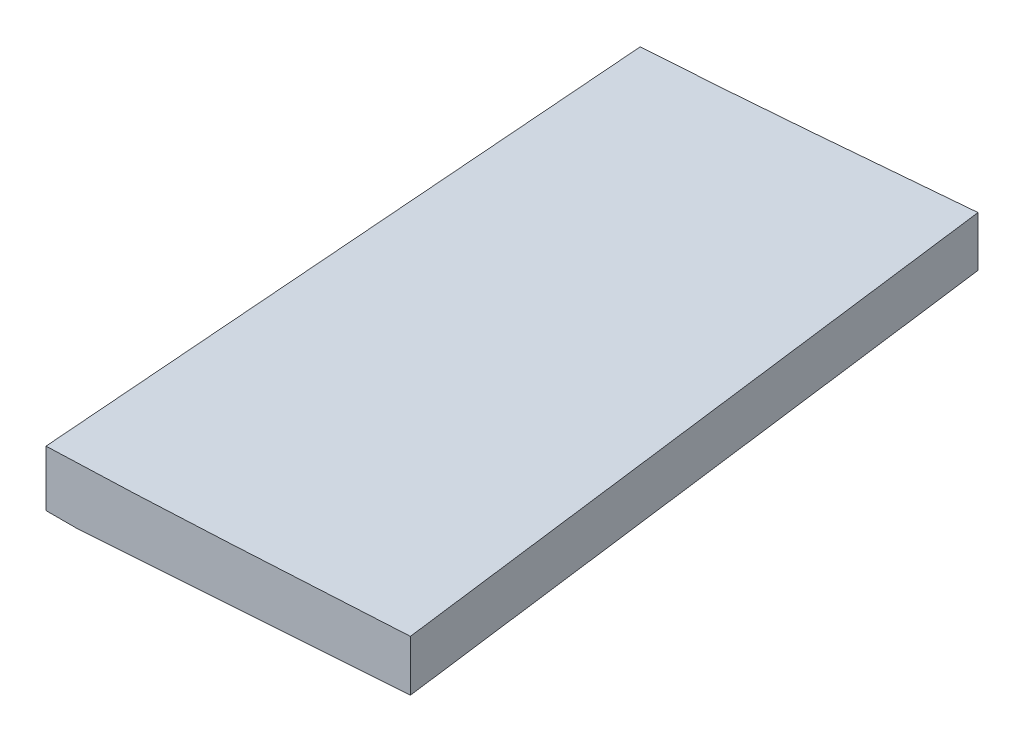
ISO-10303-21;
HEADER;
FILE_DESCRIPTION(('STEP AP214'),'2;1');
FILE_NAME('part.step','',(''),(''),'','','');
FILE_SCHEMA(('AUTOMOTIVE_DESIGN { 1 0 10303 214 1 1 1 1 }'));
ENDSEC;
DATA;
#1=APPLICATION_CONTEXT('core data for automotive mechanical design processes');
#2=APPLICATION_PROTOCOL_DEFINITION('international standard','automotive_design',2000,#1);
#3=PRODUCT_CONTEXT('',#1,'mechanical');
#4=PRODUCT('Part','Part','',(#3));
#5=PRODUCT_RELATED_PRODUCT_CATEGORY('part','',(#4));
#6=PRODUCT_DEFINITION_FORMATION('','',#4);
#7=PRODUCT_DEFINITION_CONTEXT('part definition',#1,'design');
#8=PRODUCT_DEFINITION('design','',#6,#7);
#9=PRODUCT_DEFINITION_SHAPE('','',#8);
#10=(LENGTH_UNIT() NAMED_UNIT(*) SI_UNIT(.MILLI.,.METRE.));
#11=(NAMED_UNIT(*) PLANE_ANGLE_UNIT() SI_UNIT($,.RADIAN.));
#12=(NAMED_UNIT(*) SI_UNIT($,.STERADIAN.) SOLID_ANGLE_UNIT());
#13=UNCERTAINTY_MEASURE_WITH_UNIT(LENGTH_MEASURE(1.E-05),#10,'distance_accuracy_value','');
#14=(GEOMETRIC_REPRESENTATION_CONTEXT(3) GLOBAL_UNCERTAINTY_ASSIGNED_CONTEXT((#13)) GLOBAL_UNIT_ASSIGNED_CONTEXT((#10,
#11,#12)) REPRESENTATION_CONTEXT('',''));
#15=CARTESIAN_POINT('',(0.,0.,0.));
#16=DIRECTION('',(0.,0.,1.));
#17=DIRECTION('',(1.,0.,0.));
#18=AXIS2_PLACEMENT_3D('',#15,#16,#17);
#19=CARTESIAN_POINT('',(0.,0.,50.8));
#20=DIRECTION('',(0.,0.,1.));
#21=DIRECTION('',(1.,0.,0.));
#22=AXIS2_PLACEMENT_3D('',#19,#20,#21);
#23=PLANE('',#22);
#24=DIRECTION('',(1.,0.,0.));
#25=VECTOR('',#24,1.);
#26=CARTESIAN_POINT('',(104.715608500928,-1.74770003692308,50.8));
#27=LINE('',#26,#25);
#28=CARTESIAN_POINT('',(129.715608500912,-1.74770003690514,50.7999999997698));
#29=VERTEX_POINT('',#28);
#30=CARTESIAN_POINT('',(122.012987748225,-1.74770003692157,50.7999999999811));
#31=VERTEX_POINT('',#30);
#32=EDGE_CURVE('E112',#29,#31,#27,.F.);
#33=ORIENTED_EDGE('',*,*,#32,.F.);
#34=CARTESIAN_POINT('',(209.230847335754,3.59145350647107,50.8));
#35=CARTESIAN_POINT('',(202.319868733382,3.12740691070065,50.8));
#36=CARTESIAN_POINT('',(195.408890131011,2.66336031493021,50.8));
#37=CARTESIAN_POINT('',(181.586932926267,1.73526712338933,50.8));
#38=CARTESIAN_POINT('',(174.675954323895,1.27122052761888,50.8));
#39=CARTESIAN_POINT('',(155.081853314658,-0.044450724408742,50.8));
#40=CARTESIAN_POINT('',(142.398730907793,-0.896075380665919,50.8));
#41=CARTESIAN_POINT('',(129.715608500928,-1.74770003692305,50.8));
#42=B_SPLINE_CURVE_WITH_KNOTS('',3,(#34,#35,#36,#37,#38,#39,#40,#41),.UNSPECIFIED.,.F.,.F.,(4,2,
2,4),(0.,20.7796217571299,41.5592435142597,79.694289428537),.UNSPECIFIED.);
#43=CARTESIAN_POINT('',(209.230847335754,3.59145350647107,50.8));
#44=VERTEX_POINT('',#43);
#45=EDGE_CURVE('E177',#44,#29,#42,.T.);
#46=ORIENTED_EDGE('',*,*,#45,.F.);
#47=DIRECTION('',(0.,-1.,0.));
#48=VECTOR('',#47,1.);
#49=CARTESIAN_POINT('',(209.230847335755,-23.8937090007613,50.8));
#50=LINE('',#49,#48);
#51=CARTESIAN_POINT('',(209.230847335754,15.7935965768528,50.8));
#52=VERTEX_POINT('',#51);
#53=EDGE_CURVE('E117',#52,#44,#50,.T.);
#54=ORIENTED_EDGE('',*,*,#53,.F.);
#55=CARTESIAN_POINT('',(122.012987748225,11.6136738216543,50.8));
#56=CARTESIAN_POINT('',(123.831202305895,11.6697555950184,50.8));
#57=CARTESIAN_POINT('',(125.649334594828,11.7285001151568,50.8));
#58=CARTESIAN_POINT('',(129.285388028684,11.8512745189948,50.8));
#59=CARTESIAN_POINT('',(131.103309176813,11.9153043077251,50.8));
#60=CARTESIAN_POINT('',(134.738938573084,12.0486103856979,50.8));
#61=CARTESIAN_POINT('',(136.556646823394,12.1178866158299,50.8));
#62=CARTESIAN_POINT('',(140.191844699359,12.2617617648499,50.8));
#63=CARTESIAN_POINT('',(142.009334325955,12.3363606599174,50.8));
#64=CARTESIAN_POINT('',(145.644035146053,12.4909545186657,50.8));
#65=CARTESIAN_POINT('',(147.461246345696,12.5709493380962,50.8));
#66=CARTESIAN_POINT('',(151.095456853728,12.7357190031892,50.8));
#67=CARTESIAN_POINT('',(152.912456161464,12.8204938631751,50.8));
#68=CARTESIAN_POINT('',(156.546261870725,12.9942063275107,50.8));
#69=CARTESIAN_POINT('',(158.363068271531,13.0831439468572,50.8));
#70=CARTESIAN_POINT('',(161.996512725705,13.2644390995254,50.8));
#71=CARTESIAN_POINT('',(163.813150778803,13.356796638236,50.8));
#72=CARTESIAN_POINT('',(167.446628356927,13.5439205111833,50.8));
#73=CARTESIAN_POINT('',(169.263467859824,13.6386872735613,50.8));
#74=CARTESIAN_POINT('',(171.988668912855,13.7819091882723,50.8));
#75=CARTESIAN_POINT('',(172.897058736758,13.8298284109242,50.8));
#76=CARTESIAN_POINT('',(174.713829807656,13.9258292212547,50.8));
#77=CARTESIAN_POINT('',(175.622211054652,13.9739108089329,50.8));
#78=CARTESIAN_POINT('',(178.347339366335,14.1184098901947,50.8));
#79=CARTESIAN_POINT('',(180.164072942083,14.2150818041659,50.8));
#80=CARTESIAN_POINT('',(183.797507896264,14.4090094308073,50.8));
#81=CARTESIAN_POINT('',(185.614209274715,14.5062651431468,50.8));
#82=CARTESIAN_POINT('',(189.247637835783,14.7014678488801,50.8));
#83=CARTESIAN_POINT('',(191.064365017125,14.799414866031,50.8));
#84=CARTESIAN_POINT('',(194.697778790493,14.9960653745356,50.8));
#85=CARTESIAN_POINT('',(196.514465382511,15.0947688660454,50.8));
#86=CARTESIAN_POINT('',(200.14780375745,15.2928291654107,50.8));
#87=CARTESIAN_POINT('',(201.964455540357,15.392185973535,50.8));
#88=CARTESIAN_POINT('',(205.597701164905,15.5919771098371,50.8));
#89=CARTESIAN_POINT('',(207.414295006503,15.6924114388152,50.8));
#90=CARTESIAN_POINT('',(209.230847335754,15.7935965768528,50.8));
#91=B_SPLINE_CURVE_WITH_KNOTS('',3,(#55,#56,#57,#58,#59,#60,#61,#62,#63,#64,#65,#66,#67,#68,#69,
#70,#71,#72,#73,#74,#75,#76,#77,#78,#79,#80,#81,#82,#83,#84,#85,#86,#87,#88,#89,#90),
.UNSPECIFIED.,.F.,.F.,(4,2,2,2,2,2,2,2,2,2,2,2,2,2,2,2,2,4),(0.,5.45723561015161,
10.9143731824322,16.3714492795163,21.8285009561696,27.2854068063289,32.742329008971,
38.1992708724324,43.6562213349929,49.1141484219722,51.8431069970752,54.5720655653104,
60.0299768726214,65.487885087859,70.9459817894309,76.4040796173361,81.8621796905274,
87.3202838175312),.UNSPECIFIED.);
#92=CARTESIAN_POINT('',(122.012987748225,11.6136738216558,50.7999999999811));
#93=VERTEX_POINT('',#92);
#94=EDGE_CURVE('E102',#93,#52,#91,.T.);
#95=ORIENTED_EDGE('',*,*,#94,.F.);
#96=DIRECTION('',(0.,-1.,0.));
#97=VECTOR('',#96,1.);
#98=CARTESIAN_POINT('',(122.012987748225,0.,50.8));
#99=LINE('',#98,#97);
#100=EDGE_CURVE('E116',#93,#31,#99,.T.);
#101=ORIENTED_EDGE('',*,*,#100,.T.);
#102=EDGE_LOOP('',(#33,#46,#54,#95,#101));
#103=FACE_BOUND('',#102,.T.);
#104=ADVANCED_FACE('F44',(#103),#23,.T.);
#105=CARTESIAN_POINT('',(122.012987748225,6.34998004884585,335.28));
#106=DIRECTION('',(-1.,0.,0.));
#107=DIRECTION('',(0.,-1.,0.));
#108=AXIS2_PLACEMENT_3D('',#105,#106,#107);
#109=PLANE('',#108);
#110=CARTESIAN_POINT('',(122.012987748225,-1.74770003692157,50.7999999999811));
#111=CARTESIAN_POINT('',(122.012987748225,0.838112262625577,17.5671143760413));
#112=CARTESIAN_POINT('',(122.012987748225,3.42334466322741,-15.6658163531607));
#113=CARTESIAN_POINT('',(122.012987748225,6.37970962163895,-53.6782010577892));
#114=CARTESIAN_POINT('',(122.012987748225,6.75141008444421,-58.4576108608578));
#115=CARTESIAN_POINT('',(122.012987748225,7.12309855329969,-63.2370215968307));
#116=B_SPLINE_CURVE_WITH_KNOTS('',3,(#110,#111,#112,#113,#114,#115),.UNSPECIFIED.,.F.,.F.,(4,2,
4),(0.,100.000000013768,114.381525443897),.UNSPECIFIED.);
#117=CARTESIAN_POINT('',(122.012987748225,7.12309855329969,-63.2370215968307));
#118=VERTEX_POINT('',#117);
#119=EDGE_CURVE('E123',#31,#118,#116,.T.);
#120=ORIENTED_EDGE('',*,*,#119,.F.);
#121=ORIENTED_EDGE('',*,*,#100,.F.);
#122=CARTESIAN_POINT('',(122.012987748225,23.2690175708451,-91.4399999999996));
#123=CARTESIAN_POINT('',(122.012987748225,21.327464667791,-67.7332510323452));
#124=CARTESIAN_POINT('',(122.012987748225,19.3854095704982,-44.0265432151862));
#125=CARTESIAN_POINT('',(122.012987748225,15.5002949874351,3.38679011814074));
#126=CARTESIAN_POINT('',(122.012987748225,13.5572355016648,27.0934156343087));
#127=CARTESIAN_POINT('',(122.012987748225,11.6136738216558,50.7999999999811));
#128=B_SPLINE_CURVE_WITH_KNOTS('',3,(#122,#123,#124,#125,#126,#127),.UNSPECIFIED.,.F.,.F.,(4,2,
4),(0.,71.3583643433733,142.716728686747),.UNSPECIFIED.);
#129=CARTESIAN_POINT('',(122.012986066742,23.2690467874278,-91.4399999999997));
#130=VERTEX_POINT('',#129);
#131=EDGE_CURVE('E100',#130,#93,#128,.T.);
#132=ORIENTED_EDGE('',*,*,#131,.F.);
#133=DIRECTION('',(0.,1.,0.));
#134=VECTOR('',#133,1.);
#135=CARTESIAN_POINT('',(122.012987748225,22.749481355623,-91.4399999999999));
#136=LINE('',#135,#134);
#137=CARTESIAN_POINT('',(122.012987748225,9.50066118034288,-91.4399999999999));
#138=VERTEX_POINT('',#137);
#139=EDGE_CURVE('E126',#138,#130,#136,.T.);
#140=ORIENTED_EDGE('',*,*,#139,.F.);
#141=CARTESIAN_POINT('',(122.012987748225,7.12309855329969,-63.2370215968307));
#142=CARTESIAN_POINT('',(122.012987748225,7.51759526218538,-67.9376666829334));
#143=CARTESIAN_POINT('',(122.012987748225,7.91297383554848,-72.6382374262489));
#144=CARTESIAN_POINT('',(122.012987748225,8.70549471122955,-82.0392302273053));
#145=CARTESIAN_POINT('',(122.012987748225,9.1026370135475,-86.7396522850462));
#146=CARTESIAN_POINT('',(122.012987748225,9.50066118034288,-91.4399999999999));
#147=B_SPLINE_CURVE_WITH_KNOTS('',3,(#141,#142,#143,#144,#145,#146),.UNSPECIFIED.,.F.,.F.,(4,2,
4),(0.,14.1515089570932,28.3030179141865),.UNSPECIFIED.);
#148=EDGE_CURVE('E186',#118,#138,#147,.T.);
#149=ORIENTED_EDGE('',*,*,#148,.F.);
#150=EDGE_LOOP('',(#120,#121,#132,#140,#149));
#151=FACE_BOUND('',#150,.T.);
#152=ADVANCED_FACE('F121',(#151),#109,.T.);
#153=CARTESIAN_POINT('',(222.012987748225,-23.8937090007613,335.28));
#154=DIRECTION('',(0.998992101682105,0.,-0.0448863094581294));
#155=DIRECTION('',(0.,1.,0.));
#156=AXIS2_PLACEMENT_3D('',#153,#154,#155);
#157=PLANE('',#156);
#158=CARTESIAN_POINT('',(222.012987748225,-11.2872773614073,335.28));
#159=CARTESIAN_POINT('',(215.621950375233,2.25782306949605,193.040730738436));
#160=CARTESIAN_POINT('',(209.230888497717,15.7971864193462,50.8009161028569));
#161=CARTESIAN_POINT('',(202.839777129521,29.3249682784286,-91.4399999999999));
#162=B_SPLINE_CURVE_WITH_KNOTS('',3,(#158,#159,#160,#161),.UNSPECIFIED.,.F.,.F.,(4,4),(0.,1.),.UNSPECIFIED.);
#163=CARTESIAN_POINT('',(202.839777129521,29.3249682784286,-91.4399999999999));
#164=VERTEX_POINT('',#163);
#165=EDGE_CURVE('E70',#52,#164,#162,.T.);
#166=ORIENTED_EDGE('',*,*,#165,.F.);
#167=ORIENTED_EDGE('',*,*,#53,.T.);
#168=CARTESIAN_POINT('',(222.012987748225,-23.8937090007613,335.28));
#169=CARTESIAN_POINT('',(215.621950375233,-10.1464646900732,193.040730738436));
#170=CARTESIAN_POINT('',(209.230888497717,3.59504253956158,50.8009161028569));
#171=CARTESIAN_POINT('',(202.839777129521,17.3249682784286,-91.4399999999999));
#172=B_SPLINE_CURVE_WITH_KNOTS('',3,(#168,#169,#170,#171),.UNSPECIFIED.,.F.,.F.,(4,4),(0.,1.),.UNSPECIFIED.);
#173=CARTESIAN_POINT('',(202.839777129521,17.3249682784286,-91.4399999999999));
#174=VERTEX_POINT('',#173);
#175=EDGE_CURVE('E62',#44,#174,#172,.T.);
#176=ORIENTED_EDGE('',*,*,#175,.T.);
#177=CARTESIAN_POINT('',(202.839777129521,17.3249682784286,-91.4399999999997));
#178=DIRECTION('',(0.,1.,0.));
#179=VECTOR('',#178,1.);
#180=LINE('',#177,#179);
#181=EDGE_CURVE('E119',#174,#164,#180,.T.);
#182=ORIENTED_EDGE('',*,*,#181,.T.);
#183=EDGE_LOOP('',(#166,#167,#176,#182));
#184=FACE_BOUND('',#183,.T.);
#185=ADVANCED_FACE('F243',(#184),#157,.T.);
#186=CARTESIAN_POINT('',(112.535518427817,22.749481355623,-91.4399999999999));
#187=DIRECTION('',(0.,0.,-1.));
#188=DIRECTION('',(1.,0.,0.));
#189=AXIS2_PLACEMENT_3D('',#186,#187,#188);
#190=PLANE('',#189);
#191=CARTESIAN_POINT('',(120.108021548784,9.31625399715528,-91.4399999999999));
#192=CARTESIAN_POINT('',(127.002334513845,9.98364685392806,-91.4399999999999));
#193=CARTESIAN_POINT('',(140.790960443968,11.3184325674736,-91.4400000000003));
#194=CARTESIAN_POINT('',(161.473899339152,13.3206111377919,-91.44));
#195=CARTESIAN_POINT('',(182.156838234336,15.3227897081103,-91.4399999999994));
#196=CARTESIAN_POINT('',(195.945464164459,16.6575754216558,-91.4399999999999));
#197=CARTESIAN_POINT('',(202.839777129521,17.3249682784286,-91.4399999999999));
#198=B_SPLINE_CURVE_WITH_KNOTS('',3,(#191,#192,#193,#194,#195,#196,#197),.UNSPECIFIED.,.F.,.F.,
(4,1,1,1,4),(0.796773836641175,0.840719353183708,0.884664869726241,0.928610386268774,
0.972555902811307),.UNSPECIFIED.);
#199=EDGE_CURVE('E209',#138,#174,#198,.T.);
#200=ORIENTED_EDGE('',*,*,#199,.F.);
#201=ORIENTED_EDGE('',*,*,#139,.T.);
#202=CARTESIAN_POINT('',(202.839777129521,29.3249682784286,-91.4399999999999));
#203=CARTESIAN_POINT('',(199.955611630451,29.0878692566778,-91.4399999999999));
#204=CARTESIAN_POINT('',(194.246518744766,28.62092272987,-91.4399999999995));
#205=CARTESIAN_POINT('',(185.788045806771,27.9310367630314,-91.4400000000001));
#206=CARTESIAN_POINT('',(177.370268633092,27.2489243930088,-91.4399999999992));
#207=CARTESIAN_POINT('',(171.744596431112,26.7965720352444,-91.4400000000002));
#208=CARTESIAN_POINT('',(164.531859976147,26.2204090461806,-91.4399999999999));
#209=CARTESIAN_POINT('',(155.753293206132,25.5268110681705,-91.4399999999987));
#210=CARTESIAN_POINT('',(142.568310615148,24.5581623597207,-91.4400000000005));
#211=CARTESIAN_POINT('',(131.571067518226,23.8360974022951,-91.4400000000004));
#212=CARTESIAN_POINT('',(122.771425252918,23.3086419393149,-91.4399999999996));
#213=CARTESIAN_POINT('',(116.171726807407,22.938349231563,-91.4399999999993));
#214=CARTESIAN_POINT('',(109.573018762723,22.5935560512976,-91.4399999999999));
#215=CARTESIAN_POINT('',(102.976346152497,22.2731731077499,-91.4400000000005));
#216=CARTESIAN_POINT('',(96.3827299152893,21.9754374909317,-91.4399999999996));
#217=CARTESIAN_POINT('',(89.7928873047449,21.7056589354515,-91.4400000000003));
#218=CARTESIAN_POINT('',(83.2067721531562,21.4915895897743,-91.4399999999996));
#219=CARTESIAN_POINT('',(76.6253225449055,21.3524173245996,-91.4400000000002));
#220=CARTESIAN_POINT('',(70.0501089820274,21.2975940157574,-91.4399999999999));
#221=CARTESIAN_POINT('',(65.6721142875005,21.3358951461287,-91.4399999999996));
#222=CARTESIAN_POINT('',(62.6061050870016,21.3980618238962,-91.4399999999999));
#223=CARTESIAN_POINT('',(60.8543451489969,21.4417333506161,-91.4399999999997));
#224=CARTESIAN_POINT('',(58.2428868795708,21.5327412341478,-91.4400000000009));
#225=CARTESIAN_POINT('',(55.6452486962394,21.6502862764848,-91.4399999999985));
#226=CARTESIAN_POINT('',(53.0591295364477,21.7949303457084,-91.4400000000005));
#227=CARTESIAN_POINT('',(50.4825009500491,21.9686658384681,-91.4399999999994));
#228=CARTESIAN_POINT('',(47.9131849358426,22.1705826208209,-91.4399999999995));
#229=CARTESIAN_POINT('',(45.3500542034651,22.4111454288413,-91.4400000000006));
#230=CARTESIAN_POINT('',(43.2191972361536,22.656471848806,-91.4399999999991));
#231=CARTESIAN_POINT('',(41.5180248452633,22.8874321984255,-91.4400000000003));
#232=CARTESIAN_POINT('',(40.2443002196361,23.0806581593835,-91.4400000000007));
#233=CARTESIAN_POINT('',(38.9731283376106,23.2965459110046,-91.4399999999991));
#234=CARTESIAN_POINT('',(37.7050816948944,23.5372544735851,-91.44));
#235=CARTESIAN_POINT('',(36.4408425747248,23.8052901636559,-91.44));
#236=CARTESIAN_POINT('',(35.1812804177387,24.1031590795125,-91.44));
#237=CARTESIAN_POINT('',(33.92790467711,24.4349142330716,-91.44));
#238=CARTESIAN_POINT('',(32.6820542894933,24.8033241170132,-91.4400000000001));
#239=CARTESIAN_POINT('',(31.4467163870874,25.2146386437529,-91.4399999999989));
#240=CARTESIAN_POINT('',(30.2229825157733,25.6690840931059,-91.440000000001));
#241=CARTESIAN_POINT('',(29.0309299856635,26.2124999655045,-91.4399999999981));
#242=CARTESIAN_POINT('',(27.9020475638924,26.8866840529463,-91.4400000000025));
#243=CARTESIAN_POINT('',(26.8600300386238,27.6957088571391,-91.4399999999973));
#244=CARTESIAN_POINT('',(26.0904952164094,28.4884325047958,-91.4400000000007));
#245=CARTESIAN_POINT('',(25.5765893398334,29.2093644545907,-91.4399999999994));
#246=CARTESIAN_POINT('',(25.2639015021194,29.7964893023725,-91.4400000000003));
#247=CARTESIAN_POINT('',(25.0498793449458,30.4297103858489,-91.4399999999994));
#248=CARTESIAN_POINT('',(25.0003838385099,30.8740834891911,-91.4399999999999));
#249=CARTESIAN_POINT('',(25.0003838385099,31.0965029420325,-91.4399999999997));
#250=B_SPLINE_CURVE_WITH_KNOTS('',3,(#202,#203,#204,#205,#206,#207,#208,#209,#210,#211,#212,
#213,#214,#215,#216,#217,#218,#219,#220,#221,#222,#223,#224,#225,#226,#227,#228,#229,#230,#231,
#232,#233,#234,#235,#236,#237,#238,#239,#240,#241,#242,#243,#244,#245,#246,#247,#248,#249),
.UNSPECIFIED.,.F.,.F.,(4,1,1,1,2,1,1,1,1,1,1,1,1,1,1,1,1,2,1,1,1,1,1,1,1,1,1,1,1,1,1,1,1,1,1,1,
1,1,1,1,1,1,1,4),(0.,0.0210721432720827,0.0421442865441653,0.063216429816248,0.0842885730883306,
0.116982404956549,0.149676236824766,0.182370068692984,0.198716984627093,0.215063900561202,
0.231410816495311,0.24775773242942,0.264104648363529,0.280451564297638,0.296798480231747,
0.313145396165856,0.329492312099965,0.345839228034074,0.352409679753848,0.358980131473621,
0.365550583193395,0.372121034913169,0.378691486632943,0.385261938352717,0.39183239007249,
0.398402841792264,0.401688067652151,0.404973293512038,0.408258519371925,0.411543745231812,
0.414828971091699,0.418114196951585,0.421399422811472,0.424684648671359,0.427969874531246,
0.431255100391133,0.43454032625102,0.437825552110907,0.441110777970794,0.444396003830681,
0.446038616760624,0.447681229690568,0.449323842620511,0.450966455550454),.UNSPECIFIED.);
#251=EDGE_CURVE('E105',#164,#130,#250,.T.);
#252=ORIENTED_EDGE('',*,*,#251,.F.);
#253=ORIENTED_EDGE('',*,*,#181,.F.);
#254=EDGE_LOOP('',(#200,#201,#252,#253));
#255=FACE_BOUND('',#254,.T.);
#256=ADVANCED_FACE('F235',(#255),#190,.T.);
#257=CARTESIAN_POINT('',(222.012987748225,-11.2872773614073,335.28));
#258=CARTESIAN_POINT('',(215.621950375233,2.25782306949605,193.040730738436));
#259=CARTESIAN_POINT('',(209.230888497717,15.7971864193462,50.8009161028569));
#260=CARTESIAN_POINT('',(202.839777129521,29.3249682784286,-91.4399999999999));
#261=CARTESIAN_POINT('',(218.569474026706,-11.3263744236417,335.28));
#262=CARTESIAN_POINT('',(212.364886061197,2.15272535408958,193.040730738436));
#263=CARTESIAN_POINT('',(206.160273591164,15.6260880507676,50.8009161028569));
#264=CARTESIAN_POINT('',(199.955611630451,29.0878692566778,-91.4399999999999));
#265=CARTESIAN_POINT('',(211.614338336714,-11.4024470677598,335.28));
#266=CARTESIAN_POINT('',(205.825097972641,1.94636141574157,193.040730738435));
#267=CARTESIAN_POINT('',(200.035833104044,15.2894328181897,50.8009161028569));
#268=CARTESIAN_POINT('',(194.246518744766,28.62092272987,-91.4399999999995));
#269=CARTESIAN_POINT('',(201.046202820784,-11.5155355801604,335.28));
#270=CARTESIAN_POINT('',(195.960183316022,1.64100708519495,193.040730738436));
#271=CARTESIAN_POINT('',(190.874139306737,14.791812669497,50.8009161028568));
#272=CARTESIAN_POINT('',(185.788045806771,27.9310367630314,-91.4400000000001));
#273=CARTESIAN_POINT('',(190.421562401009,-11.6239646215105,335.28));
#274=CARTESIAN_POINT('',(186.071163978279,1.34135026762067,193.040730738436));
#275=CARTESIAN_POINT('',(181.720741051026,14.3009280756986,50.8009161028572));
#276=CARTESIAN_POINT('',(177.370268633092,27.2489243930088,-91.4399999999992));
#277=CARTESIAN_POINT('',(183.356302448994,-11.6915854526342,335.28));
#278=CARTESIAN_POINT('',(179.48576660961,1.1454855942834,193.040730738436));
#279=CARTESIAN_POINT('',(175.615206265701,13.9768195601478,50.8009161028566));
#280=CARTESIAN_POINT('',(171.744596431112,26.7965720352444,-91.4400000000002));
#281=CARTESIAN_POINT('',(174.388523129358,-11.7731432923107,335.28));
#282=CARTESIAN_POINT('',(171.103001578197,0.899059371477806,193.040730738436));
#283=CARTESIAN_POINT('',(167.817455522512,13.5655249542131,50.8009161028569));
#284=CARTESIAN_POINT('',(164.531859976147,26.2204090461806,-91.4399999999999));
#285=CARTESIAN_POINT('',(163.489709248502,-11.8633262155867,335.28));
#286=CARTESIAN_POINT('',(160.910936734288,0.60773809662375,193.040730738436));
#287=CARTESIAN_POINT('',(158.33213971555,13.073065327781,50.8009161028575));
#288=CARTESIAN_POINT('',(155.753293206132,25.5268110681705,-91.4399999999987));
#289=CARTESIAN_POINT('',(147.154849918996,-11.9140829368556,335.28));
#290=CARTESIAN_POINT('',(145.626036317623,0.251017379627905,193.040730738435));
#291=CARTESIAN_POINT('',(144.097198211725,12.4103806150582,50.8009161028563));
#292=CARTESIAN_POINT('',(142.568310615148,24.5581623597207,-91.4400000000005));
#293=CARTESIAN_POINT('',(133.547087797304,-11.8513571386047,335.280000000001));
#294=CARTESIAN_POINT('',(132.888447204188,0.0521462593199381,193.040730738436));
#295=CARTESIAN_POINT('',(132.229782106547,11.9499125761914,50.8009161028566));
#296=CARTESIAN_POINT('',(131.571067518226,23.8360974022951,-91.4400000000004));
#297=CARTESIAN_POINT('',(122.659949238186,-11.7410017797558,335.28));
#298=CARTESIAN_POINT('',(122.697140743006,-0.0501019891075296,193.040730738435));
#299=CARTESIAN_POINT('',(122.734307743302,11.6350607204876,50.8009161028568));
#300=CARTESIAN_POINT('',(122.771425252918,23.3086419393149,-91.4399999999996));
#301=CARTESIAN_POINT('',(114.493192339325,-11.6262316691835,335.28));
#302=CARTESIAN_POINT('',(115.052736661929,-0.0970194846432594,193.040730738436));
#303=CARTESIAN_POINT('',(115.612256480008,11.4264556188438,50.8009161028573));
#304=CARTESIAN_POINT('',(116.171726807407,22.938349231563,-91.4399999999993));
#305=CARTESIAN_POINT('',(106.324095444975,-11.4813070111323,335.28));
#306=CARTESIAN_POINT('',(107.407102717467,-0.115334106030914,193.040730738436));
#307=CARTESIAN_POINT('',(108.490085485435,11.2449017180172,50.8009161028569));
#308=CARTESIAN_POINT('',(109.573018762723,22.5935560512976,-91.4399999999999));
#309=CARTESIAN_POINT('',(98.1517013141778,-11.3060491598229,335.28));
#310=CARTESIAN_POINT('',(99.7599490935271,-0.105289853007253,193.040730738435));
#311=CARTESIAN_POINT('',(101.368172368352,11.0897323727552,50.8009161028561));
#312=CARTESIAN_POINT('',(102.976346152497,22.2731731077499,-91.4400000000005));
#313=CARTESIAN_POINT('',(89.9750279012389,-11.1021701951475,335.280000000001));
#314=CARTESIAN_POINT('',(92.1109614058318,-0.0686157488297257,193.040730738436));
#315=CARTESIAN_POINT('',(94.2468704059006,10.9592016164349,50.8009161028571));
#316=CARTESIAN_POINT('',(96.3827299152893,21.9754374909317,-91.4399999999996));
#317=CARTESIAN_POINT('',(81.7931246917491,-10.8683806880935,335.28));
#318=CARTESIAN_POINT('',(84.4597450626571,-0.00268226262042188,193.040730738435));
#319=CARTESIAN_POINT('',(87.1263409290411,10.8572790817994,50.8009161028563));
#320=CARTESIAN_POINT('',(89.7928873047449,21.7056589354515,-91.4400000000003));
#321=CARTESIAN_POINT('',(73.6060212603565,-10.5736728833086,335.280000000001));
#322=CARTESIAN_POINT('',(76.8063043911992,0.122433158677056,193.040730738436));
#323=CARTESIAN_POINT('',(80.0065630175178,10.8128021196095,50.8009161028571));
#324=CARTESIAN_POINT('',(83.2067721531562,21.4915895897743,-91.4399999999996));
#325=CARTESIAN_POINT('',(65.4143764421152,-10.1899300133236,335.28));
#326=CARTESIAN_POINT('',(69.1513913096214,0.331870983608891,193.040730738435));
#327=CARTESIAN_POINT('',(72.8883816726035,10.8479348994881,50.8009161028565));
#328=CARTESIAN_POINT('',(76.6253225449055,21.3524173245996,-91.4400000000002));
#329=CARTESIAN_POINT('',(57.218819398707,-9.70421420475117,335.28));
#330=CARTESIAN_POINT('',(61.4959487597233,0.637407086376427,193.040730738436));
#331=CARTESIAN_POINT('',(65.7730536162154,10.9732912964508,50.8009161028569));
#332=CARTESIAN_POINT('',(70.0501089820274,21.2975940157574,-91.4399999999999));
#333=CARTESIAN_POINT('',(51.753855165005,-9.29406576406763,335.28));
#334=CARTESIAN_POINT('',(56.3933077057463,0.923606423622542,193.040730738436));
#335=CARTESIAN_POINT('',(61.0327357419635,11.1355415302595,50.8009161028569));
#336=CARTESIAN_POINT('',(65.6721142875005,21.3358951461287,-91.4399999999996));
#337=CARTESIAN_POINT('',(47.9240317369891,-8.96448844964143,335.28));
#338=CARTESIAN_POINT('',(52.818089020236,1.16404685916252,193.040730738436));
#339=CARTESIAN_POINT('',(57.7121217989589,11.2868450869133,50.8009161028569));
#340=CARTESIAN_POINT('',(62.6061050870016,21.3980618238962,-91.4399999999999));
#341=CARTESIAN_POINT('',(45.7218209357501,-8.76534620327357,335.28));
#342=CARTESIAN_POINT('',(50.7660285067419,1.3113655323144,193.040730738436));
#343=CARTESIAN_POINT('',(55.8102115732095,11.3823401868492,50.8009161028569));
#344=CARTESIAN_POINT('',(60.8543451489969,21.4417333506161,-91.4399999999997));
#345=CARTESIAN_POINT('',(42.4027754578273,-8.432707682147,335.279999999999));
#346=CARTESIAN_POINT('',(47.6828454316512,1.56346050757602,193.040730738435));
#347=CARTESIAN_POINT('',(52.9628909009511,11.5538916162458,50.800916102856));
#348=CARTESIAN_POINT('',(58.2428868795708,21.5327412341478,-91.4400000000009));
#349=CARTESIAN_POINT('',(39.0713826541202,-8.06384555902649,335.280000000001));
#350=CARTESIAN_POINT('',(44.5960375014028,1.84855027043535,193.040730738436));
#351=CARTESIAN_POINT('',(50.1206678441612,11.755209018844,50.8009161028579));
#352=CARTESIAN_POINT('',(55.6452486962394,21.6502862764848,-91.4399999999985));
#353=CARTESIAN_POINT('',(35.7310935187291,-7.65734912890353,335.28));
#354=CARTESIAN_POINT('',(41.5071383578781,2.1677625802585,193.040730738435));
#355=CARTESIAN_POINT('',(47.283158692503,11.9871372083673,50.8009161028561));
#356=CARTESIAN_POINT('',(53.0591295364477,21.7949303457084,-91.4400000000005));
#357=CARTESIAN_POINT('',(32.3856911285866,-7.21086412592674,335.280000000001));
#358=CARTESIAN_POINT('',(38.4179939023169,2.52333107982961,193.040730738436));
#359=CARTESIAN_POINT('',(44.4502721715231,12.2517892045327,50.8009161028573));
#360=CARTESIAN_POINT('',(50.4825009500491,21.9686658384681,-91.4399999999994));
#361=CARTESIAN_POINT('',(29.0388190535993,-6.72415739916843,335.28));
#362=CARTESIAN_POINT('',(35.3303071809232,2.91510782511942,193.040730738435));
#363=CARTESIAN_POINT('',(41.621770803723,12.5486359683541,50.8009161028569));
#364=CARTESIAN_POINT('',(47.9131849358426,22.1705826208209,-91.4399999999995));
#365=CARTESIAN_POINT('',(25.6949743291155,-6.19196852419016,335.28));
#366=CARTESIAN_POINT('',(32.2467004538082,3.35008801111173,193.040730738435));
#367=CARTESIAN_POINT('',(38.7984020739767,12.8864074653604,50.8009161028563));
#368=CARTESIAN_POINT('',(45.3500542034651,22.4111454288413,-91.4400000000006));
#369=CARTESIAN_POINT('',(22.9174344404017,-5.69180499526552,335.28));
#370=CARTESIAN_POINT('',(29.6847215388951,3.76530583704974,193.040730738436));
#371=CARTESIAN_POINT('',(36.4519841328644,13.2166795883118,50.8009161028573));
#372=CARTESIAN_POINT('',(43.2191972361536,22.656471848806,-91.4399999999991));
#373=CARTESIAN_POINT('',(20.7051166447645,-5.24830690376412,335.28));
#374=CARTESIAN_POINT('',(27.6427855448402,4.13795801459049,193.040730738436));
#375=CARTESIAN_POINT('',(34.5804299403918,13.5184858518919,50.8009161028565));
#376=CARTESIAN_POINT('',(41.5180248452633,22.8874321984255,-91.4400000000003));
#377=CARTESIAN_POINT('',(19.0522311011638,-4.89036823785229,335.28));
#378=CARTESIAN_POINT('',(26.1162869738974,4.44099244551772,193.040730738435));
#379=CARTESIAN_POINT('',(33.1803183421069,13.7666160478345,50.8009161028563));
#380=CARTESIAN_POINT('',(40.2443002196361,23.0806581593835,-91.4400000000007));
#381=CARTESIAN_POINT('',(17.4072680026639,-4.50393109256964,335.28));
#382=CARTESIAN_POINT('',(24.5959209475556,4.77057979291317,193.040730738436));
#383=CARTESIAN_POINT('',(31.7845493879232,14.0393535973428,50.8009161028572));
#384=CARTESIAN_POINT('',(38.9731283376106,23.2965459110046,-91.4399999999991));
#385=CARTESIAN_POINT('',(15.7719559277294,-4.08585733946278,335.280000000001));
#386=CARTESIAN_POINT('',(23.0830306833606,5.12953181584458,193.040730738436));
#387=CARTESIAN_POINT('',(30.3940809344676,14.3391838900987,50.8009161028569));
#388=CARTESIAN_POINT('',(37.7050816948944,23.5372544735851,-91.44));
#389=CARTESIAN_POINT('',(14.1482110615158,-3.63320964201411,335.28));
#390=CARTESIAN_POINT('',(21.5791210658283,5.52064217750062,193.040730738435));
#391=CARTESIAN_POINT('',(29.0100065656166,14.6687569159621,50.8009161028565));
#392=CARTESIAN_POINT('',(36.4408425747248,23.8052901636559,-91.44));
#393=CARTESIAN_POINT('',(12.5379887560416,-3.14346189168235,335.28));
#394=CARTESIAN_POINT('',(20.0857854765168,5.94643031634065,193.040730738436));
#395=CARTESIAN_POINT('',(27.6335576924679,15.0305854433104,50.8009161028568));
#396=CARTESIAN_POINT('',(35.1812804177387,24.1031590795125,-91.44));
#397=CARTESIAN_POINT('',(10.9443022314088,-2.61171665583038,335.28));
#398=CARTESIAN_POINT('',(18.6055358798854,6.41151219142834,193.040730738436));
#399=CARTESIAN_POINT('',(26.2667450238378,15.4290039576339,50.8009161028568));
#400=CARTESIAN_POINT('',(33.92790467711,24.4349142330716,-91.44));
#401=CARTESIAN_POINT('',(9.3696983908296,-2.03559280479495,335.28));
#402=CARTESIAN_POINT('',(17.140516523627,6.9183980534325,193.040730738435));
#403=CARTESIAN_POINT('',(24.9113101519002,15.8666518306067,50.8009161028565));
#404=CARTESIAN_POINT('',(32.6820542894933,24.8033241170132,-91.4400000000001));
#405=CARTESIAN_POINT('',(7.81930606312509,-1.40676584170021,335.28));
#406=CARTESIAN_POINT('',(15.6951423376886,7.47472087107555,193.040730738436));
#407=CARTESIAN_POINT('',(23.5709541077281,16.3504705027981,50.8009161028575));
#408=CARTESIAN_POINT('',(31.4467163870874,25.2146386437529,-91.4399999999989));
#409=CARTESIAN_POINT('',(6.2945427283012,-0.728623104338553,335.28));
#410=CARTESIAN_POINT('',(14.270722157368,8.07829784576766,193.040730738435));
#411=CARTESIAN_POINT('',(22.2468770819107,16.8794817148207,50.800916102856));
#412=CARTESIAN_POINT('',(30.2229825157733,25.6690840931059,-91.440000000001));
#413=CARTESIAN_POINT('',(4.81910701938389,0.0452105722964347,335.28));
#414=CARTESIAN_POINT('',(12.8897475080532,8.77532558765721,193.040730738436));
#415=CARTESIAN_POINT('',(20.9603634921985,17.4997035219648,50.8009161028581));
#416=CARTESIAN_POINT('',(29.0309299856635,26.2124999655045,-91.4399999999981));
#417=CARTESIAN_POINT('',(3.44019696912771,0.973032127436344,335.28));
#418=CARTESIAN_POINT('',(11.5941800006254,9.61860132023108,193.040730738434));
#419=CARTESIAN_POINT('',(19.748138527599,18.2584334319726,50.800916102855));
#420=CARTESIAN_POINT('',(27.9020475638924,26.8866840529463,-91.4400000000025));
#421=CARTESIAN_POINT('',(2.18607039010745,2.05737434257256,335.28));
#422=CARTESIAN_POINT('',(10.4107564395223,10.6111710650528,193.040730738437));
#423=CARTESIAN_POINT('',(18.6354179844131,19.1592307064798,50.8009161028586));
#424=CARTESIAN_POINT('',(26.8600300386238,27.6957088571391,-91.4399999999973));
#425=CARTESIAN_POINT('',(1.27839650729546,3.09358418996593,335.28));
#426=CARTESIAN_POINT('',(9.54912891024288,11.5662188458673,193.040730738435));
#427=CARTESIAN_POINT('',(17.8198368086662,20.0331164207154,50.8009161028561));
#428=CARTESIAN_POINT('',(26.0904952164094,28.4884325047958,-91.4400000000007));
#429=CARTESIAN_POINT('',(0.675104053522571,4.01206497822802,335.28));
#430=CARTESIAN_POINT('',(8.9756319822023,12.418850021307,193.040730738436));
#431=CARTESIAN_POINT('',(17.2761354063579,20.8198979833327,50.8009161028571));
#432=CARTESIAN_POINT('',(25.5765893398334,29.2093644545907,-91.4399999999994));
#433=CARTESIAN_POINT('',(0.311283524258083,4.74838484159257,335.28));
#434=CARTESIAN_POINT('',(8.62885568345465,13.1054382128106,193.040730738435));
#435=CARTESIAN_POINT('',(16.9464033381271,21.4567545029755,50.8009161028565));
#436=CARTESIAN_POINT('',(25.2639015021194,29.7964893023725,-91.4400000000003));
#437=CARTESIAN_POINT('',(0.0633372908855968,5.53486679411943,335.28));
#438=CARTESIAN_POINT('',(8.3922174754818,13.8408332089873,193.040730738436));
#439=CARTESIAN_POINT('',(16.7210731555539,22.141062542802,50.8009161028571));
#440=CARTESIAN_POINT('',(25.0498793449458,30.4297103858489,-91.4399999999994));
#441=CARTESIAN_POINT('',(9.29076906829817E-07,6.07768392100159,335.28));
#442=CARTESIAN_POINT('',(8.3334947321307,14.3508356613562,193.040730738436));
#443=CARTESIAN_POINT('',(16.6669640306604,22.6182503206576,50.8009161028569));
#444=CARTESIAN_POINT('',(25.0003838385099,30.8740834891911,-91.4399999999999));
#445=CARTESIAN_POINT('',(9.29077044083409E-07,6.34998004884586,335.28));
#446=CARTESIAN_POINT('',(8.33349473213078,14.6065062308661,193.040730738436));
#447=CARTESIAN_POINT('',(16.6669640306604,22.8572953318332,50.8009161028569));
#448=CARTESIAN_POINT('',(25.0003838385099,31.0965029420325,-91.4399999999997));
#449=B_SPLINE_SURFACE_WITH_KNOTS('',3,3,((#257,#258,#259,#260),(#261,#262,#263,#264),(#265,#266,
#267,#268),(#269,#270,#271,#272),(#273,#274,#275,#276),(#277,#278,#279,#280),(#281,#282,#283,
#284),(#285,#286,#287,#288),(#289,#290,#291,#292),(#293,#294,#295,#296),(#297,#298,#299,#300),
(#301,#302,#303,#304),(#305,#306,#307,#308),(#309,#310,#311,#312),(#313,#314,#315,#316),(#317,
#318,#319,#320),(#321,#322,#323,#324),(#325,#326,#327,#328),(#329,#330,#331,#332),(#333,#334,
#335,#336),(#337,#338,#339,#340),(#341,#342,#343,#344),(#345,#346,#347,#348),(#349,#350,#351,
#352),(#353,#354,#355,#356),(#357,#358,#359,#360),(#361,#362,#363,#364),(#365,#366,#367,#368),
(#369,#370,#371,#372),(#373,#374,#375,#376),(#377,#378,#379,#380),(#381,#382,#383,#384),(#385,
#386,#387,#388),(#389,#390,#391,#392),(#393,#394,#395,#396),(#397,#398,#399,#400),(#401,#402,
#403,#404),(#405,#406,#407,#408),(#409,#410,#411,#412),(#413,#414,#415,#416),(#417,#418,#419,
#420),(#421,#422,#423,#424),(#425,#426,#427,#428),(#429,#430,#431,#432),(#433,#434,#435,#436),
(#437,#438,#439,#440),(#441,#442,#443,#444),(#445,#446,#447,#448)),.UNSPECIFIED.,.F.,.F.,.F.,(4,
1,1,1,2,1,1,1,1,1,1,1,1,1,1,1,1,2,1,1,1,1,1,1,1,1,1,1,1,1,1,1,1,1,1,1,1,1,1,1,1,1,1,4),(4,4),
(0.,0.0210721432720827,0.0421442865441653,0.063216429816248,0.0842885730883306,
0.116982404956549,0.149676236824766,0.182370068692984,0.198716984627093,0.215063900561202,
0.231410816495311,0.24775773242942,0.264104648363529,0.280451564297638,0.296798480231747,
0.313145396165856,0.329492312099965,0.345839228034074,0.352409679753848,0.358980131473621,
0.365550583193395,0.372121034913169,0.378691486632943,0.385261938352717,0.39183239007249,
0.398402841792264,0.401688067652151,0.404973293512038,0.408258519371925,0.411543745231812,
0.414828971091699,0.418114196951585,0.421399422811472,0.424684648671359,0.427969874531246,
0.431255100391133,0.43454032625102,0.437825552110907,0.441110777970794,0.444396003830681,
0.446038616760624,0.447681229690568,0.449323842620511,0.450966455550454),(0.,1.),.UNSPECIFIED.);
#450=ORIENTED_EDGE('',*,*,#251,.T.);
#451=ORIENTED_EDGE('',*,*,#131,.T.);
#452=ORIENTED_EDGE('',*,*,#94,.T.);
#453=ORIENTED_EDGE('',*,*,#165,.T.);
#454=EDGE_LOOP('',(#450,#451,#452,#453));
#455=FACE_BOUND('',#454,.T.);
#456=ADVANCED_FACE('F46',(#455),#449,.F.);
#457=CARTESIAN_POINT('',(148.93082104307,-23.8937090007613,335.28));
#458=CARTESIAN_POINT('',(139.323254044884,-12.8160361171643,193.040730738436));
#459=CARTESIAN_POINT('',(129.715662542174,-1.74410031462064,50.8009161028569));
#460=CARTESIAN_POINT('',(120.108021548784,9.31625399715528,-91.4399999999999));
#461=CARTESIAN_POINT('',(155.021001601833,-23.8937090007613,335.28));
#462=CARTESIAN_POINT('',(145.68147873908,-12.5935718315734,193.040730738436));
#463=CARTESIAN_POINT('',(136.341931371802,-1.29917174343879,50.8009161028569));
#464=CARTESIAN_POINT('',(127.002334513845,9.98364685392806,-91.4399999999999));
#465=CARTESIAN_POINT('',(167.201362719359,-23.8937090007613,335.28));
#466=CARTESIAN_POINT('',(158.397928127471,-12.1486432603916,193.040730738435));
#467=CARTESIAN_POINT('',(149.59446903106,-0.409314601075073,50.8009161028564));
#468=CARTESIAN_POINT('',(140.790960443968,11.3184325674736,-91.4400000000003));
#469=CARTESIAN_POINT('',(185.471904395647,-23.8937090007613,335.28));
#470=CARTESIAN_POINT('',(177.472602210058,-11.4812504036188,193.040730738436));
#471=CARTESIAN_POINT('',(169.473275519945,0.925471112470457,50.8009161028568));
#472=CARTESIAN_POINT('',(161.473899339152,13.3206111377919,-91.44));
#473=CARTESIAN_POINT('',(203.742446071936,-23.8937090007613,335.28));
#474=CARTESIAN_POINT('',(196.547276292646,-10.813857546846,193.040730738436));
#475=CARTESIAN_POINT('',(189.352082008831,2.26025682601603,50.8009161028571));
#476=CARTESIAN_POINT('',(182.156838234336,15.3227897081103,-91.4399999999994));
#477=CARTESIAN_POINT('',(215.922807189462,-23.8937090007613,335.28));
#478=CARTESIAN_POINT('',(209.263725681037,-10.3689289756642,193.040730738436));
#479=CARTESIAN_POINT('',(202.604619668088,3.15011396837973,50.8009161028569));
#480=CARTESIAN_POINT('',(195.945464164459,16.6575754216558,-91.4399999999999));
#481=CARTESIAN_POINT('',(222.012987748225,-23.8937090007613,335.28));
#482=CARTESIAN_POINT('',(215.621950375233,-10.1464646900732,193.040730738436));
#483=CARTESIAN_POINT('',(209.230888497717,3.59504253956158,50.8009161028569));
#484=CARTESIAN_POINT('',(202.839777129521,17.3249682784286,-91.4399999999999));
#485=B_SPLINE_SURFACE_WITH_KNOTS('',3,3,((#457,#458,#459,#460),(#461,#462,#463,#464),(#465,#466,
#467,#468),(#469,#470,#471,#472),(#473,#474,#475,#476),(#477,#478,#479,#480),(#481,#482,#483,
#484)),.UNSPECIFIED.,.F.,.F.,.F.,(4,1,1,1,4),(4,4),(0.796773836641175,0.840719353183708,
0.884664869726241,0.928610386268774,0.972555902811307),(0.,1.),.UNSPECIFIED.);
#486=CARTESIAN_POINT('',(148.93082104307,-23.8937090007613,335.28));
#487=CARTESIAN_POINT('',(139.323254044884,-12.8160361171643,193.040730738436));
#488=CARTESIAN_POINT('',(129.715662542174,-1.74410031462064,50.8009161028569));
#489=CARTESIAN_POINT('',(120.108021548784,9.31625399715528,-91.4399999999999));
#490=B_SPLINE_CURVE_WITH_KNOTS('',3,(#486,#487,#488,#489),.UNSPECIFIED.,.F.,.F.,(4,4),(0.,1.),.UNSPECIFIED.);
#491=EDGE_CURVE('E11',#29,#118,#490,.T.);
#492=ORIENTED_EDGE('',*,*,#491,.T.);
#493=ORIENTED_EDGE('',*,*,#148,.T.);
#494=ORIENTED_EDGE('',*,*,#199,.T.);
#495=ORIENTED_EDGE('',*,*,#175,.F.);
#496=ORIENTED_EDGE('',*,*,#45,.T.);
#497=EDGE_LOOP('',(#492,#493,#494,#495,#496));
#498=FACE_BOUND('',#497,.T.);
#499=ADVANCED_FACE('F146',(#498),#485,.F.);
#500=CARTESIAN_POINT('',(98.93082104307,-23.8937090007613,335.28));
#501=CARTESIAN_POINT('',(89.323254044884,-12.8160361171643,193.040730738436));
#502=CARTESIAN_POINT('',(79.7156625421738,-1.74410031462064,50.8009161028569));
#503=CARTESIAN_POINT('',(70.1080215487835,9.31625399715528,-91.4399999999999));
#504=CARTESIAN_POINT('',(103.097487709737,-23.8937090007613,335.28));
#505=CARTESIAN_POINT('',(93.4899207115506,-12.8160361171643,193.040730738436));
#506=CARTESIAN_POINT('',(83.8823292088405,-1.74410031462064,50.8009161028569));
#507=CARTESIAN_POINT('',(74.2746882154502,9.31625399715528,-91.4399999999997));
#508=CARTESIAN_POINT('',(111.43082104307,-23.8937090007613,335.28));
#509=CARTESIAN_POINT('',(101.823254044884,-12.8160361171643,193.040730738436));
#510=CARTESIAN_POINT('',(92.2156625421738,-1.74410031462064,50.8009161028569));
#511=CARTESIAN_POINT('',(82.6080215487835,9.31625399715527,-91.4399999999999));
#512=CARTESIAN_POINT('',(123.93082104307,-23.8937090007613,335.279999999999));
#513=CARTESIAN_POINT('',(114.323254044884,-12.8160361171644,193.040730738435));
#514=CARTESIAN_POINT('',(104.715662542174,-1.74410031462064,50.8009161028561));
#515=CARTESIAN_POINT('',(95.1080215487836,9.3162539971553,-91.4400000000005));
#516=CARTESIAN_POINT('',(136.43082104307,-23.8937090007613,335.280000000001));
#517=CARTESIAN_POINT('',(126.823254044884,-12.8160361171643,193.040730738436));
#518=CARTESIAN_POINT('',(117.215662542174,-1.74410031462065,50.8009161028573));
#519=CARTESIAN_POINT('',(107.608021548783,9.31625399715526,-91.4399999999994));
#520=CARTESIAN_POINT('',(144.764154376403,-23.8937090007613,335.28));
#521=CARTESIAN_POINT('',(135.156587378217,-12.8160361171643,193.040730738436));
#522=CARTESIAN_POINT('',(125.548995875507,-1.74410031462064,50.8009161028569));
#523=CARTESIAN_POINT('',(115.941354882117,9.31625399715528,-91.4399999999997));
#524=CARTESIAN_POINT('',(148.93082104307,-23.8937090007613,335.28));
#525=CARTESIAN_POINT('',(139.323254044884,-12.8160361171643,193.040730738436));
#526=CARTESIAN_POINT('',(129.715662542174,-1.74410031462064,50.8009161028569));
#527=CARTESIAN_POINT('',(120.108021548784,9.31625399715528,-91.4399999999999));
#528=B_SPLINE_SURFACE_WITH_KNOTS('',3,3,((#500,#501,#502,#503),(#504,#505,#506,#507),(#508,#509,
#510,#511),(#512,#513,#514,#515),(#516,#517,#518,#519),(#520,#521,#522,#523),(#524,#525,#526,
#527)),.UNSPECIFIED.,.F.,.F.,.F.,(4,1,1,1,4),(4,4),(0.684963327266946,0.712915954610504,
0.740868581954061,0.768821209297618,0.796773836641175),(0.,1.),.UNSPECIFIED.);
#529=ORIENTED_EDGE('',*,*,#32,.T.);
#530=ORIENTED_EDGE('',*,*,#119,.T.);
#531=ORIENTED_EDGE('',*,*,#491,.F.);
#532=EDGE_LOOP('',(#529,#530,#531));
#533=FACE_BOUND('',#532,.T.);
#534=ADVANCED_FACE('F157',(#533),#528,.F.);
#535=CLOSED_SHELL('',(#104,#152,#185,#256,#456,#499,#534));
#536=MANIFOLD_SOLID_BREP('B2',#535);
#537=ADVANCED_BREP_SHAPE_REPRESENTATION('',(#18,#536),#14);
#538=SHAPE_DEFINITION_REPRESENTATION(#9,#537);
ENDSEC;
END-ISO-10303-21;
